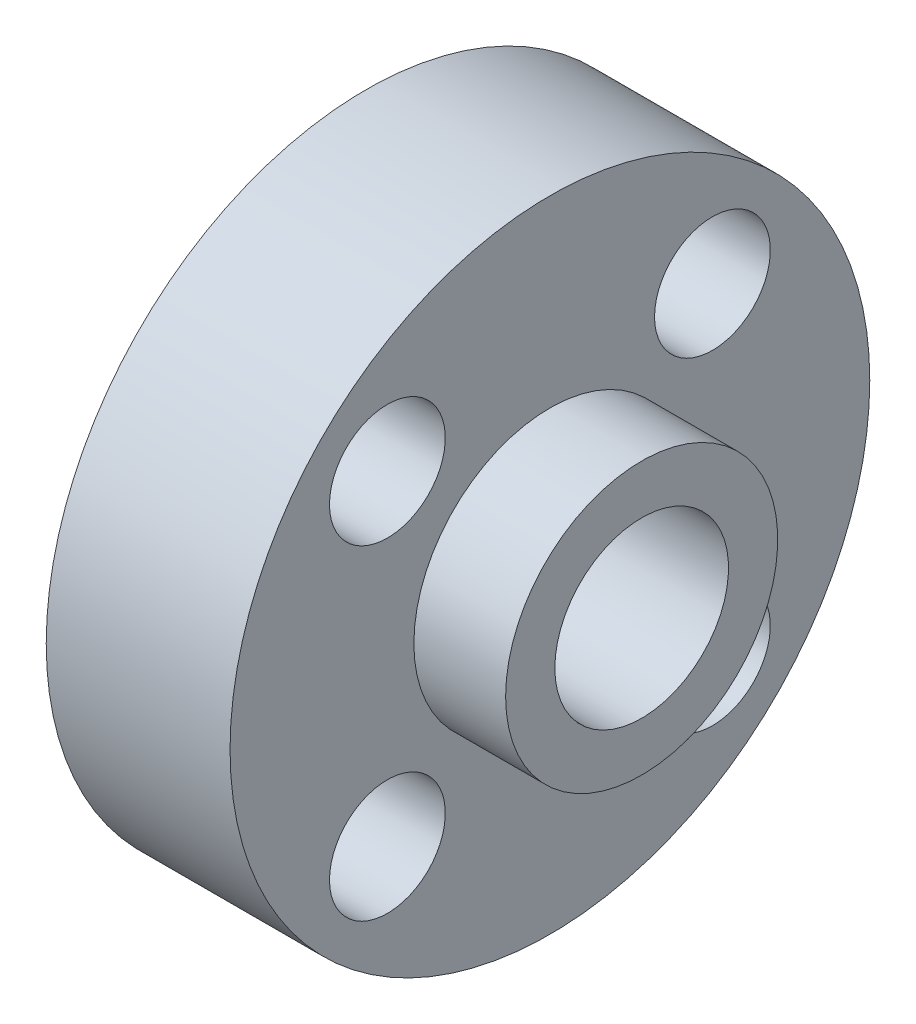
ISO-10303-21;
HEADER;
FILE_DESCRIPTION(('STEP AP214'),'2;1');
FILE_NAME('part.step','',(''),(''),'','','');
FILE_SCHEMA(('AUTOMOTIVE_DESIGN { 1 0 10303 214 1 1 1 1 }'));
ENDSEC;
DATA;
#1=APPLICATION_CONTEXT('core data for automotive mechanical design processes');
#2=APPLICATION_PROTOCOL_DEFINITION('international standard','automotive_design',2000,#1);
#3=PRODUCT_CONTEXT('',#1,'mechanical');
#4=PRODUCT('Part','Part','',(#3));
#5=PRODUCT_RELATED_PRODUCT_CATEGORY('part','',(#4));
#6=PRODUCT_DEFINITION_FORMATION('','',#4);
#7=PRODUCT_DEFINITION_CONTEXT('part definition',#1,'design');
#8=PRODUCT_DEFINITION('design','',#6,#7);
#9=PRODUCT_DEFINITION_SHAPE('','',#8);
#10=(LENGTH_UNIT() NAMED_UNIT(*) SI_UNIT(.MILLI.,.METRE.));
#11=(NAMED_UNIT(*) PLANE_ANGLE_UNIT() SI_UNIT($,.RADIAN.));
#12=(NAMED_UNIT(*) SI_UNIT($,.STERADIAN.) SOLID_ANGLE_UNIT());
#13=UNCERTAINTY_MEASURE_WITH_UNIT(LENGTH_MEASURE(1.E-05),#10,'distance_accuracy_value','');
#14=(GEOMETRIC_REPRESENTATION_CONTEXT(3) GLOBAL_UNCERTAINTY_ASSIGNED_CONTEXT((#13)) GLOBAL_UNIT_ASSIGNED_CONTEXT((#10,
#11,#12)) REPRESENTATION_CONTEXT('',''));
#15=CARTESIAN_POINT('',(0.,0.,0.));
#16=DIRECTION('',(0.,0.,1.));
#17=DIRECTION('',(1.,0.,0.));
#18=AXIS2_PLACEMENT_3D('',#15,#16,#17);
#19=CARTESIAN_POINT('',(-40.2001302083333,0.,0.));
#20=DIRECTION('',(1.,0.,0.));
#21=DIRECTION('',(0.,0.,-1.));
#22=AXIS2_PLACEMENT_3D('',#19,#20,#21);
#23=PLANE('',#22);
#24=CARTESIAN_POINT('',(-40.2001302083333,0.,0.));
#25=DIRECTION('',(-1.,0.,0.));
#26=DIRECTION('',(0.,0.,1.));
#27=AXIS2_PLACEMENT_3D('',#24,#25,#26);
#28=CIRCLE('',#27,3.);
#29=CARTESIAN_POINT('',(-40.2001302083333,0.,3.));
#30=VERTEX_POINT('',#29);
#31=EDGE_CURVE('E53',#30,#30,#28,.T.);
#32=ORIENTED_EDGE('',*,*,#31,.F.);
#33=EDGE_LOOP('',(#32));
#34=FACE_BOUND('',#33,.T.);
#35=CARTESIAN_POINT('',(-40.2001302083333,0.,0.));
#36=DIRECTION('',(-1.,0.,0.));
#37=DIRECTION('',(0.,0.,1.));
#38=AXIS2_PLACEMENT_3D('',#35,#36,#37);
#39=CIRCLE('',#38,4.7);
#40=CARTESIAN_POINT('',(-40.2001302083333,0.,4.7));
#41=VERTEX_POINT('',#40);
#42=EDGE_CURVE('E10',#41,#41,#39,.T.);
#43=ORIENTED_EDGE('',*,*,#42,.T.);
#44=EDGE_LOOP('',(#43));
#45=FACE_BOUND('',#44,.T.);
#46=ADVANCED_FACE('F30',(#34,#45),#23,.F.);
#47=CARTESIAN_POINT('',(-53.2970052083333,0.,0.));
#48=DIRECTION('',(-1.,0.,0.));
#49=DIRECTION('',(0.,0.,1.));
#50=AXIS2_PLACEMENT_3D('',#47,#48,#49);
#51=CYLINDRICAL_SURFACE('',#50,4.7);
#52=ORIENTED_EDGE('',*,*,#42,.F.);
#53=EDGE_LOOP('',(#52));
#54=FACE_BOUND('',#53,.T.);
#55=CARTESIAN_POINT('',(-37.0201302083333,0.,0.));
#56=DIRECTION('',(-1.,0.,0.));
#57=DIRECTION('',(0.,0.,1.));
#58=AXIS2_PLACEMENT_3D('',#55,#56,#57);
#59=CIRCLE('',#58,4.7);
#60=CARTESIAN_POINT('',(-37.0201302083333,0.,4.7));
#61=VERTEX_POINT('',#60);
#62=EDGE_CURVE('E41',#61,#61,#59,.T.);
#63=ORIENTED_EDGE('',*,*,#62,.T.);
#64=EDGE_LOOP('',(#63));
#65=FACE_BOUND('',#64,.T.);
#66=ADVANCED_FACE('F131',(#54,#65),#51,.T.);
#67=CARTESIAN_POINT('',(-37.0201302083333,0.,-4.7));
#68=DIRECTION('',(1.,0.,0.));
#69=DIRECTION('',(0.,0.,-1.));
#70=AXIS2_PLACEMENT_3D('',#67,#68,#69);
#71=PLANE('',#70);
#72=CARTESIAN_POINT('',(-37.0201302083333,5.61442784262126,5.61442784262112));
#73=DIRECTION('',(-1.,0.,0.));
#74=DIRECTION('',(0.,-1.,0.));
#75=AXIS2_PLACEMENT_3D('',#72,#73,#74);
#76=CIRCLE('',#75,2.);
#77=CARTESIAN_POINT('',(-37.0201302083333,3.61442784262126,5.61442784262114));
#78=VERTEX_POINT('',#77);
#79=EDGE_CURVE('E64',#78,#78,#76,.T.);
#80=ORIENTED_EDGE('',*,*,#79,.F.);
#81=EDGE_LOOP('',(#80));
#82=FACE_BOUND('',#81,.T.);
#83=CARTESIAN_POINT('',(-37.0201302083333,-5.61442784262118,5.6144278426212));
#84=DIRECTION('',(-1.,0.,0.));
#85=DIRECTION('',(0.,0.,-1.));
#86=AXIS2_PLACEMENT_3D('',#83,#84,#85);
#87=CIRCLE('',#86,2.);
#88=CARTESIAN_POINT('',(-37.0201302083333,-5.61442784262118,3.6144278426212));
#89=VERTEX_POINT('',#88);
#90=EDGE_CURVE('E61',#89,#89,#87,.T.);
#91=ORIENTED_EDGE('',*,*,#90,.F.);
#92=EDGE_LOOP('',(#91));
#93=FACE_BOUND('',#92,.T.);
#94=CARTESIAN_POINT('',(-37.0201302083333,-5.61442784262122,-5.61442784262116));
#95=DIRECTION('',(-1.,0.,0.));
#96=DIRECTION('',(0.,1.,0.));
#97=AXIS2_PLACEMENT_3D('',#94,#95,#96);
#98=CIRCLE('',#97,2.);
#99=CARTESIAN_POINT('',(-37.0201302083333,-3.61442784262122,-5.61442784262116));
#100=VERTEX_POINT('',#99);
#101=EDGE_CURVE('E58',#100,#100,#98,.T.);
#102=ORIENTED_EDGE('',*,*,#101,.F.);
#103=EDGE_LOOP('',(#102));
#104=FACE_BOUND('',#103,.T.);
#105=CARTESIAN_POINT('',(-37.0201302083333,5.61442784262118,-5.6144278426212));
#106=DIRECTION('',(-1.,0.,0.));
#107=DIRECTION('',(0.,0.,1.));
#108=AXIS2_PLACEMENT_3D('',#105,#106,#107);
#109=CIRCLE('',#108,2.);
#110=CARTESIAN_POINT('',(-37.0201302083333,5.61442784262118,-3.6144278426212));
#111=VERTEX_POINT('',#110);
#112=EDGE_CURVE('E54',#111,#111,#109,.T.);
#113=ORIENTED_EDGE('',*,*,#112,.F.);
#114=EDGE_LOOP('',(#113));
#115=FACE_BOUND('',#114,.T.);
#116=ORIENTED_EDGE('',*,*,#62,.F.);
#117=EDGE_LOOP('',(#116));
#118=FACE_BOUND('',#117,.T.);
#119=CARTESIAN_POINT('',(-37.0201302083333,0.,0.));
#120=DIRECTION('',(-1.,0.,0.));
#121=DIRECTION('',(0.,0.,1.));
#122=AXIS2_PLACEMENT_3D('',#119,#120,#121);
#123=CIRCLE('',#122,11.05);
#124=CARTESIAN_POINT('',(-37.0201302083333,0.,11.05));
#125=VERTEX_POINT('',#124);
#126=EDGE_CURVE('E46',#125,#125,#123,.T.);
#127=ORIENTED_EDGE('',*,*,#126,.T.);
#128=EDGE_LOOP('',(#127));
#129=FACE_BOUND('',#128,.T.);
#130=ADVANCED_FACE('F100',(#82,#93,#104,#115,#118,#129),#71,.F.);
#131=CARTESIAN_POINT('',(-53.2970052083333,0.,0.));
#132=DIRECTION('',(-1.,0.,0.));
#133=DIRECTION('',(0.,0.,1.));
#134=AXIS2_PLACEMENT_3D('',#131,#132,#133);
#135=CYLINDRICAL_SURFACE('',#134,11.05);
#136=CARTESIAN_POINT('',(-31.3451302083333,0.,-11.05));
#137=CARTESIAN_POINT('',(-31.3451347657817,0.138535178969198,-11.0499974686992));
#138=CARTESIAN_POINT('',(-31.3566842583246,0.277124414870294,-11.047368394039));
#139=CARTESIAN_POINT('',(-31.4025242809649,0.55035816038072,-11.0371346033821));
#140=CARTESIAN_POINT('',(-31.4368302897828,0.684999919826578,-11.0295265007553));
#141=CARTESIAN_POINT('',(-31.5270473952303,0.946351146069514,-11.0101807046834));
#142=CARTESIAN_POINT('',(-31.5829351392618,1.07306901532559,-10.9984474760714));
#143=CARTESIAN_POINT('',(-31.7146532533677,1.31532636423872,-10.9721139075424));
#144=CARTESIAN_POINT('',(-31.790483386229,1.43086597683789,-10.9575136017296));
#145=CARTESIAN_POINT('',(-31.9613051967248,1.64946582897903,-10.9267629293887));
#146=CARTESIAN_POINT('',(-32.0565727961294,1.75230761065863,-10.9105922318907));
#147=CARTESIAN_POINT('',(-32.2629732528739,1.94069721632042,-10.878664647576));
#148=CARTESIAN_POINT('',(-32.3741076035238,2.02624341068387,-10.8629077998747));
#149=CARTESIAN_POINT('',(-32.6107206403364,2.17859183261036,-10.8333905461894));
#150=CARTESIAN_POINT('',(-32.7363543412377,2.24515879528731,-10.8196561403144));
#151=CARTESIAN_POINT('',(-32.9973875487626,2.35614919880918,-10.796031791589));
#152=CARTESIAN_POINT('',(-33.1327857969257,2.40057548733988,-10.7861413543717));
#153=CARTESIAN_POINT('',(-33.4071271573634,2.46529609887246,-10.7715323060186));
#154=CARTESIAN_POINT('',(-33.5459741660384,2.48597862528871,-10.7667305989985));
#155=CARTESIAN_POINT('',(-33.8252439031697,2.5038321909553,-10.7625933128208));
#156=CARTESIAN_POINT('',(-33.965666421422,2.50100633029327,-10.7632570129314));
#157=CARTESIAN_POINT('',(-34.2411951057804,2.47223512536489,-10.7699004418861));
#158=CARTESIAN_POINT('',(-34.3763515328956,2.44674335015242,-10.775775873008));
#159=CARTESIAN_POINT('',(-34.6404182040461,2.37408365604073,-10.7920155533678));
#160=CARTESIAN_POINT('',(-34.7693280752597,2.32691444509448,-10.802380070168));
#161=CARTESIAN_POINT('',(-35.0185038963537,2.21182931829656,-10.8265312521615));
#162=CARTESIAN_POINT('',(-35.1386874920297,2.143741260663,-10.8403461270284));
#163=CARTESIAN_POINT('',(-35.3660900945078,1.9888720895275,-10.8698244596064));
#164=CARTESIAN_POINT('',(-35.4733072141066,1.90208826005324,-10.8854881857544));
#165=CARTESIAN_POINT('',(-35.6743420550986,1.70990181962498,-10.9173449250341));
#166=CARTESIAN_POINT('',(-35.7677914578564,1.60411416676263,-10.9335417895284));
#167=CARTESIAN_POINT('',(-35.9356854127979,1.37818254775952,-10.9643098473388));
#168=CARTESIAN_POINT('',(-36.010129572383,1.25803828512407,-10.9788810070688));
#169=CARTESIAN_POINT('',(-36.1380007993904,1.00633702781466,-11.0048085021139));
#170=CARTESIAN_POINT('',(-36.1913769690913,0.874753320469848,-11.0161570336327));
#171=CARTESIAN_POINT('',(-36.2751567132021,0.604169833161706,-11.034302968742));
#172=CARTESIAN_POINT('',(-36.3055638674121,0.465171212454925,-11.0411010815121));
#173=CARTESIAN_POINT('',(-36.3420006144425,0.186860495275626,-11.0492783517252));
#174=CARTESIAN_POINT('',(-36.348532963223,0.0476174133332158,-11.0507692507554));
#175=CARTESIAN_POINT('',(-36.3384010777072,-0.229970622720129,-11.0484784130789));
#176=CARTESIAN_POINT('',(-36.3217385329043,-0.36831564150772,-11.0446970603979));
#177=CARTESIAN_POINT('',(-36.266106270829,-0.638496033310976,-11.0323573731012));
#178=CARTESIAN_POINT('',(-36.2274026793795,-0.770389039953454,-11.0238560579555));
#179=CARTESIAN_POINT('',(-36.1290843232459,-1.02580957081328,-11.0030291180397));
#180=CARTESIAN_POINT('',(-36.0694676937165,-1.14933634782964,-10.9907031522313));
#181=CARTESIAN_POINT('',(-35.9299849441036,-1.38657900576045,-10.9633201008813));
#182=CARTESIAN_POINT('',(-35.8498266113306,-1.50011854849276,-10.9482245809437));
#183=CARTESIAN_POINT('',(-35.6719179909027,-1.71231494298578,-10.9170508820538));
#184=CARTESIAN_POINT('',(-35.5741652473163,-1.8109697135039,-10.9009725661242));
#185=CARTESIAN_POINT('',(-35.3615286403444,-1.99260346932019,-10.8692556152757));
#186=CARTESIAN_POINT('',(-35.2463437507104,-2.07523317138076,-10.8536320018118));
#187=CARTESIAN_POINT('',(-35.0034379902651,-2.21997934847289,-10.8249553465839));
#188=CARTESIAN_POINT('',(-34.8757176727781,-2.2820967284078,-10.811902191434));
#189=CARTESIAN_POINT('',(-34.6120603059594,-2.38362200906372,-10.7899743136361));
#190=CARTESIAN_POINT('',(-34.4761756340373,-2.42316049546664,-10.7810756193173));
#191=CARTESIAN_POINT('',(-34.1994620634576,-2.47878112159198,-10.7684248029988));
#192=CARTESIAN_POINT('',(-34.0586340239648,-2.49486731688939,-10.7646717911695));
#193=CARTESIAN_POINT('',(-33.7795599813477,-2.50294484254296,-10.7627961003508));
#194=CARTESIAN_POINT('',(-33.6413306207192,-2.49549089532478,-10.7645437941672));
#195=CARTESIAN_POINT('',(-33.3681529987284,-2.45794659316738,-10.7731779308509));
#196=CARTESIAN_POINT('',(-33.2332046929824,-2.42785654460879,-10.7800643041659));
#197=CARTESIAN_POINT('',(-32.970897725627,-2.34617054677613,-10.7981345431471));
#198=CARTESIAN_POINT('',(-32.8435109873545,-2.29466069270581,-10.8093011906911));
#199=CARTESIAN_POINT('',(-32.5991070426896,-2.17166931112005,-10.8346794116197));
#200=CARTESIAN_POINT('',(-32.4820910044047,-2.10018553759107,-10.8488913273947));
#201=CARTESIAN_POINT('',(-32.2590276686996,-1.9374587803661,-10.8791419628974));
#202=CARTESIAN_POINT('',(-32.1532714643818,-1.84582279327649,-10.8952134785653));
#203=CARTESIAN_POINT('',(-31.958455816679,-1.64618244704617,-10.9271580559927));
#204=CARTESIAN_POINT('',(-31.8694002557157,-1.53817429237176,-10.9430310708079));
#205=CARTESIAN_POINT('',(-31.7093064502271,-1.30701989814213,-10.9730559944475));
#206=CARTESIAN_POINT('',(-31.6385398358246,-1.18368175489585,-10.9871804925533));
#207=CARTESIAN_POINT('',(-31.5188556185285,-0.926563557240404,-11.0118391408392));
#208=CARTESIAN_POINT('',(-31.4699202891328,-0.792792078539198,-11.0223762022827));
#209=CARTESIAN_POINT('',(-31.403680853684,-0.549137810072976,-11.0368651946442));
#210=CARTESIAN_POINT('',(-31.3817674791712,-0.440540462306541,-11.0417594976069));
#211=CARTESIAN_POINT('',(-31.3524907030212,-0.221306840345493,-11.0483278301591));
#212=CARTESIAN_POINT('',(-31.3451265675551,-0.110670669268363,-11.0500020221633));
#213=CARTESIAN_POINT('',(-31.3451302083333,0.,-11.05));
#214=B_SPLINE_CURVE_WITH_KNOTS('',3,(#136,#137,#138,#139,#140,#141,#142,#143,#144,#145,#146,
#147,#148,#149,#150,#151,#152,#153,#154,#155,#156,#157,#158,#159,#160,#161,#162,#163,#164,#165,
#166,#167,#168,#169,#170,#171,#172,#173,#174,#175,#176,#177,#178,#179,#180,#181,#182,#183,#184,
#185,#186,#187,#188,#189,#190,#191,#192,#193,#194,#195,#196,#197,#198,#199,#200,#201,#202,#203,
#204,#205,#206,#207,#208,#209,#210,#211,#212,#213),.UNSPECIFIED.,.T.,.F.,(4,2,2,2,2,2,2,2,2,2,2,
2,2,2,2,2,2,2,2,2,2,2,2,2,2,2,2,2,2,2,2,2,2,2,2,2,2,2,4),(0.,0.415200333937034,
0.830683372350487,1.2457180898483,1.66074787076434,2.0821399607225,2.50357173645346,
2.9300205273311,3.35641445512039,3.77573297448606,4.19499619854192,4.60605374648434,
5.0171357979976,5.43169561673744,5.8463157000748,6.27054919340257,6.69479144957406,
7.1200524409568,7.54524714026966,7.96143474948825,8.37759204559127,8.78882803282417,
9.20010069988188,9.61758444403025,10.0351265082735,10.4609407255014,10.886736155378,
11.3100433735258,11.7332773810064,12.1466129574272,12.5599429394333,12.9716273913896,
13.3833581547979,13.8039713364727,14.2246821777895,14.6513225995566,15.0776159657674,
15.4093210026298,15.7410093086555),.UNSPECIFIED.);
#215=CARTESIAN_POINT('',(-31.3451302083333,0.,-11.05));
#216=VERTEX_POINT('',#215);
#217=EDGE_CURVE('E70',#216,#216,#214,.T.);
#218=ORIENTED_EDGE('',*,*,#217,.T.);
#219=EDGE_LOOP('',(#218));
#220=FACE_BOUND('',#219,.T.);
#221=ORIENTED_EDGE('',*,*,#126,.F.);
#222=EDGE_LOOP('',(#221));
#223=FACE_BOUND('',#222,.T.);
#224=CARTESIAN_POINT('',(-30.6701302083333,0.,0.));
#225=DIRECTION('',(-1.,0.,0.));
#226=DIRECTION('',(0.,0.,1.));
#227=AXIS2_PLACEMENT_3D('',#224,#225,#226);
#228=CIRCLE('',#227,11.05);
#229=CARTESIAN_POINT('',(-30.6701302083333,0.,11.05));
#230=VERTEX_POINT('',#229);
#231=EDGE_CURVE('E95',#230,#230,#228,.T.);
#232=ORIENTED_EDGE('',*,*,#231,.T.);
#233=EDGE_LOOP('',(#232));
#234=FACE_BOUND('',#233,.T.);
#235=ADVANCED_FACE('F102',(#220,#223,#234),#135,.T.);
#236=CARTESIAN_POINT('',(-30.6701302083333,0.,-11.05));
#237=DIRECTION('',(-1.,0.,0.));
#238=DIRECTION('',(0.,0.,1.));
#239=AXIS2_PLACEMENT_3D('',#236,#237,#238);
#240=PLANE('',#239);
#241=CARTESIAN_POINT('',(-30.6701302083333,5.61442784262126,5.61442784262112));
#242=DIRECTION('',(-1.,0.,0.));
#243=DIRECTION('',(0.,0.,1.));
#244=AXIS2_PLACEMENT_3D('',#241,#242,#243);
#245=CIRCLE('',#244,2.);
#246=CARTESIAN_POINT('',(-30.6701302083333,5.61442784262126,7.61442784262112));
#247=VERTEX_POINT('',#246);
#248=EDGE_CURVE('E62',#247,#247,#245,.T.);
#249=ORIENTED_EDGE('',*,*,#248,.T.);
#250=EDGE_LOOP('',(#249));
#251=FACE_BOUND('',#250,.T.);
#252=CARTESIAN_POINT('',(-30.6701302083333,-5.61442784262118,5.6144278426212));
#253=DIRECTION('',(-1.,0.,0.));
#254=DIRECTION('',(0.,0.,1.));
#255=AXIS2_PLACEMENT_3D('',#252,#253,#254);
#256=CIRCLE('',#255,2.);
#257=CARTESIAN_POINT('',(-30.6701302083333,-5.61442784262118,7.6144278426212));
#258=VERTEX_POINT('',#257);
#259=EDGE_CURVE('E59',#258,#258,#256,.T.);
#260=ORIENTED_EDGE('',*,*,#259,.T.);
#261=EDGE_LOOP('',(#260));
#262=FACE_BOUND('',#261,.T.);
#263=CARTESIAN_POINT('',(-30.6701302083333,-5.61442784262122,-5.61442784262116));
#264=DIRECTION('',(-1.,0.,0.));
#265=DIRECTION('',(0.,0.,1.));
#266=AXIS2_PLACEMENT_3D('',#263,#264,#265);
#267=CIRCLE('',#266,2.);
#268=CARTESIAN_POINT('',(-30.6701302083333,-5.61442784262122,-3.61442784262116));
#269=VERTEX_POINT('',#268);
#270=EDGE_CURVE('E55',#269,#269,#267,.T.);
#271=ORIENTED_EDGE('',*,*,#270,.T.);
#272=EDGE_LOOP('',(#271));
#273=FACE_BOUND('',#272,.T.);
#274=CARTESIAN_POINT('',(-30.6701302083333,5.61442784262118,-5.6144278426212));
#275=DIRECTION('',(-1.,0.,0.));
#276=DIRECTION('',(0.,0.,1.));
#277=AXIS2_PLACEMENT_3D('',#274,#275,#276);
#278=CIRCLE('',#277,2.);
#279=CARTESIAN_POINT('',(-30.6701302083333,5.61442784262118,-3.6144278426212));
#280=VERTEX_POINT('',#279);
#281=EDGE_CURVE('E50',#280,#280,#278,.T.);
#282=ORIENTED_EDGE('',*,*,#281,.T.);
#283=EDGE_LOOP('',(#282));
#284=FACE_BOUND('',#283,.T.);
#285=ORIENTED_EDGE('',*,*,#231,.F.);
#286=EDGE_LOOP('',(#285));
#287=FACE_BOUND('',#286,.T.);
#288=CARTESIAN_POINT('',(-30.6701302083333,0.,0.));
#289=DIRECTION('',(-1.,0.,0.));
#290=DIRECTION('',(0.,0.,1.));
#291=AXIS2_PLACEMENT_3D('',#288,#289,#290);
#292=CIRCLE('',#291,4.7);
#293=CARTESIAN_POINT('',(-30.6701302083333,0.,4.7));
#294=VERTEX_POINT('',#293);
#295=EDGE_CURVE('E92',#294,#294,#292,.T.);
#296=ORIENTED_EDGE('',*,*,#295,.T.);
#297=EDGE_LOOP('',(#296));
#298=FACE_BOUND('',#297,.T.);
#299=ADVANCED_FACE('F105',(#251,#262,#273,#284,#287,#298),#240,.F.);
#300=CARTESIAN_POINT('',(-53.2970052083333,0.,0.));
#301=DIRECTION('',(-1.,0.,0.));
#302=DIRECTION('',(0.,0.,1.));
#303=AXIS2_PLACEMENT_3D('',#300,#301,#302);
#304=CYLINDRICAL_SURFACE('',#303,4.7);
#305=ORIENTED_EDGE('',*,*,#295,.F.);
#306=EDGE_LOOP('',(#305));
#307=FACE_BOUND('',#306,.T.);
#308=CARTESIAN_POINT('',(-27.5001302083333,0.,0.));
#309=DIRECTION('',(-1.,0.,0.));
#310=DIRECTION('',(0.,0.,1.));
#311=AXIS2_PLACEMENT_3D('',#308,#309,#310);
#312=CIRCLE('',#311,4.7);
#313=CARTESIAN_POINT('',(-27.5001302083333,0.,4.7));
#314=VERTEX_POINT('',#313);
#315=EDGE_CURVE('E87',#314,#314,#312,.T.);
#316=ORIENTED_EDGE('',*,*,#315,.T.);
#317=EDGE_LOOP('',(#316));
#318=FACE_BOUND('',#317,.T.);
#319=ADVANCED_FACE('F111',(#307,#318),#304,.T.);
#320=CARTESIAN_POINT('',(-27.5001302083333,0.,-4.7));
#321=DIRECTION('',(-1.,0.,0.));
#322=DIRECTION('',(0.,0.,1.));
#323=AXIS2_PLACEMENT_3D('',#320,#321,#322);
#324=PLANE('',#323);
#325=CARTESIAN_POINT('',(-27.5001302083333,0.,0.));
#326=DIRECTION('',(-1.,0.,0.));
#327=DIRECTION('',(0.,0.,1.));
#328=AXIS2_PLACEMENT_3D('',#325,#326,#327);
#329=CIRCLE('',#328,3.);
#330=CARTESIAN_POINT('',(-27.5001302083333,0.,3.));
#331=VERTEX_POINT('',#330);
#332=EDGE_CURVE('E84',#331,#331,#329,.T.);
#333=ORIENTED_EDGE('',*,*,#332,.T.);
#334=EDGE_LOOP('',(#333));
#335=FACE_BOUND('',#334,.T.);
#336=ORIENTED_EDGE('',*,*,#315,.F.);
#337=EDGE_LOOP('',(#336));
#338=FACE_BOUND('',#337,.T.);
#339=ADVANCED_FACE('F117',(#335,#338),#324,.F.);
#340=CARTESIAN_POINT('',(-27.5001302083333,0.,0.));
#341=DIRECTION('',(-1.,0.,0.));
#342=DIRECTION('',(0.,0.,1.));
#343=AXIS2_PLACEMENT_3D('',#340,#341,#342);
#344=CYLINDRICAL_SURFACE('',#343,3.);
#345=CARTESIAN_POINT('',(-31.3451302083333,0.,-3.));
#346=CARTESIAN_POINT('',(-31.345135093887,-0.118757533193203,-2.99999522795205));
#347=CARTESIAN_POINT('',(-31.3536527122379,-0.237551281104128,-2.99288670594742));
#348=CARTESIAN_POINT('',(-31.3870929316851,-0.471182492492811,-2.96510762868268));
#349=CARTESIAN_POINT('',(-31.4120276823086,-0.586016959612417,-2.94442702942008));
#350=CARTESIAN_POINT('',(-31.476442325666,-0.807829942407298,-2.89142690238865));
#351=CARTESIAN_POINT('',(-31.515835282687,-0.914850920904904,-2.8591769655007));
#352=CARTESIAN_POINT('',(-31.6071472562759,-1.11984139043408,-2.78529176182902));
#353=CARTESIAN_POINT('',(-31.6590705050066,-1.21780780775234,-2.74365332434936));
#354=CARTESIAN_POINT('',(-31.7945839581415,-1.43789998519767,-2.63674191529867));
#355=CARTESIAN_POINT('',(-31.8828004125155,-1.5556821965722,-2.56840549256191));
#356=CARTESIAN_POINT('',(-32.0756545340847,-1.77202398328147,-2.42422624777673));
#357=CARTESIAN_POINT('',(-32.1803377775764,-1.87052845158605,-2.34836281453276));
#358=CARTESIAN_POINT('',(-32.3492144848244,-2.00437263805588,-2.23294886313738));
#359=CARTESIAN_POINT('',(-32.4080857845246,-2.04699726278816,-2.19383679994997));
#360=CARTESIAN_POINT('',(-32.5296358112938,-2.12715295529554,-2.11620611809194));
#361=CARTESIAN_POINT('',(-32.5923158032041,-2.16468231743739,-2.07768770195023));
#362=CARTESIAN_POINT('',(-32.7213975326689,-2.23441122570747,-2.00250543288661));
#363=CARTESIAN_POINT('',(-32.7877899930581,-2.26662332666227,-1.9658373575465));
#364=CARTESIAN_POINT('',(-32.9245764922617,-2.32553690612792,-1.89577686630311));
#365=CARTESIAN_POINT('',(-32.9949670556751,-2.3522430799868,-1.86238167220904));
#366=CARTESIAN_POINT('',(-33.1467972985334,-2.40193513934006,-1.79791918980412));
#367=CARTESIAN_POINT('',(-33.2286543010568,-2.42433807692598,-1.76736311251003));
#368=CARTESIAN_POINT('',(-33.3970199771464,-2.46101313675502,-1.71593180556003));
#369=CARTESIAN_POINT('',(-33.483516794948,-2.47530499393792,-1.69503310194197));
#370=CARTESIAN_POINT('',(-33.6608956167128,-2.49481072799048,-1.66620928968844));
#371=CARTESIAN_POINT('',(-33.751818167404,-2.49991205058667,-1.65844510563092));
#372=CARTESIAN_POINT('',(-33.9336928213361,-2.5000856937119,-1.65818308531825));
#373=CARTESIAN_POINT('',(-34.0246449249487,-2.49515788278405,-1.66568544916939));
#374=CARTESIAN_POINT('',(-34.2106549191604,-2.47505262029594,-1.69541639464497));
#375=CARTESIAN_POINT('',(-34.3054239540504,-2.45905577113332,-1.71881932066466));
#376=CARTESIAN_POINT('',(-34.4893411895355,-2.41742550503028,-1.77688235738913));
#377=CARTESIAN_POINT('',(-34.5784695790481,-2.3917601104429,-1.81157977103024));
#378=CARTESIAN_POINT('',(-34.7329572868744,-2.33816270346874,-1.88002226126136));
#379=CARTESIAN_POINT('',(-34.799442450745,-2.31177513033566,-1.91250316845438));
#380=CARTESIAN_POINT('',(-34.9287810151132,-2.25404424958637,-1.98021996661529));
#381=CARTESIAN_POINT('',(-34.9916322561992,-2.22269803586306,-2.01545746697785));
#382=CARTESIAN_POINT('',(-35.175097049353,-2.12149677560466,-2.12342648109724));
#383=CARTESIAN_POINT('',(-35.2905443559394,-2.04450664231778,-2.19837696967437));
#384=CARTESIAN_POINT('',(-35.5133971707877,-1.86765914501415,-2.35079897952277));
#385=CARTESIAN_POINT('',(-35.6200685323252,-1.76681805277629,-2.42819792618944));
#386=CARTESIAN_POINT('',(-35.8162425531507,-1.5448438833615,-2.57509054043284));
#387=CARTESIAN_POINT('',(-35.9057822413896,-1.42375565615774,-2.64460112267363));
#388=CARTESIAN_POINT('',(-36.0445450474319,-1.19411179169417,-2.75428914126547));
#389=CARTESIAN_POINT('',(-36.098273106521,-1.08972732107278,-2.79748350073995));
#390=CARTESIAN_POINT('',(-36.1914729535887,-0.871071458330379,-2.87307804019801));
#391=CARTESIAN_POINT('',(-36.2309536399139,-0.756806292780775,-2.90548495660805));
#392=CARTESIAN_POINT('',(-36.2935474582655,-0.51995430121543,-2.95709834265565));
#393=CARTESIAN_POINT('',(-36.3165341549909,-0.397310923125319,-2.97620280955844));
#394=CARTESIAN_POINT('',(-36.3438394402605,-0.148559976923737,-2.99891434528972));
#395=CARTESIAN_POINT('',(-36.3481705191835,-0.0224547835240113,-3.00253178304177));
#396=CARTESIAN_POINT('',(-36.3384677688896,0.213310199456566,-2.99444999039147));
#397=CARTESIAN_POINT('',(-36.3265715696182,0.32313054083585,-2.98453350716313));
#398=CARTESIAN_POINT('',(-36.2888632581218,0.538644964400596,-2.95325589460136));
#399=CARTESIAN_POINT('',(-36.2630494766144,0.644338549989553,-2.93189339242796));
#400=CARTESIAN_POINT('',(-36.1985068128781,0.850565499199248,-2.87889521546186));
#401=CARTESIAN_POINT('',(-36.1596094188891,0.951010682223306,-2.84712564891975));
#402=CARTESIAN_POINT('',(-36.0707345759966,1.14365900898103,-2.7753612473389));
#403=CARTESIAN_POINT('',(-36.02075303134,1.23585908831209,-2.73536337221809));
#404=CARTESIAN_POINT('',(-35.8866984129864,1.45067439735099,-2.62975152158594));
#405=CARTESIAN_POINT('',(-35.797397625066,1.5683435954073,-2.56070244234715));
#406=CARTESIAN_POINT('',(-35.6022898256777,1.78428994740847,-2.41522445403191));
#407=CARTESIAN_POINT('',(-35.4964317529786,1.88250490855172,-2.33877300422835));
#408=CARTESIAN_POINT('',(-35.3257182404047,2.0157331478429,-2.22269805598601));
#409=CARTESIAN_POINT('',(-35.2662319353573,2.05811069143949,-2.1834115173603));
#410=CARTESIAN_POINT('',(-35.1434093923011,2.13771669597406,-2.10553153817181));
#411=CARTESIAN_POINT('',(-35.0800717806692,2.17494330406755,-2.06693835133607));
#412=CARTESIAN_POINT('',(-34.9496418044181,2.24398857026757,-1.9917610848264));
#413=CARTESIAN_POINT('',(-34.8825599837997,2.27582148781537,-1.95517188634212));
#414=CARTESIAN_POINT('',(-34.7443401038335,2.33388856739459,-1.88547561448179));
#415=CARTESIAN_POINT('',(-34.673205837914,2.36012785984655,-1.85236536450791));
#416=CARTESIAN_POINT('',(-34.5208598399815,2.40837357148322,-1.78925557416047));
#417=CARTESIAN_POINT('',(-34.4392957572596,2.42988314318544,-1.75970711786654));
#418=CARTESIAN_POINT('',(-34.2716782543907,2.46482255689514,-1.71043063887427));
#419=CARTESIAN_POINT('',(-34.1856366370055,2.47827257713357,-1.69067811225259));
#420=CARTESIAN_POINT('',(-34.009492600921,2.49617289535263,-1.6641531597946));
#421=CARTESIAN_POINT('',(-33.9193548785827,2.5005179918396,-1.65753251048391));
#422=CARTESIAN_POINT('',(-33.7392769955494,2.49938197104456,-1.65924308630666));
#423=CARTESIAN_POINT('',(-33.6493368932082,2.49389826274012,-1.66757825402154));
#424=CARTESIAN_POINT('',(-33.4634576329428,2.47265263848541,-1.69892898735519));
#425=CARTESIAN_POINT('',(-33.3678999378007,2.45585812550762,-1.72341371023857));
#426=CARTESIAN_POINT('',(-33.1825989122506,2.41250339675092,-1.78358728037387));
#427=CARTESIAN_POINT('',(-33.092875979624,2.38591088285909,-1.81931312531326));
#428=CARTESIAN_POINT('',(-32.9373411669785,2.33050835844919,-1.88952619366194));
#429=CARTESIAN_POINT('',(-32.8703864490984,2.30325853049531,-1.92277816627791));
#430=CARTESIAN_POINT('',(-32.7401838219089,2.24370627018012,-1.9919518523057));
#431=CARTESIAN_POINT('',(-32.6769380973335,2.21140090020864,-2.0278751115052));
#432=CARTESIAN_POINT('',(-32.4924006469914,2.10716294428985,-2.13775931167912));
#433=CARTESIAN_POINT('',(-32.3763832833414,2.02793576743751,-2.2137978016432));
#434=CARTESIAN_POINT('',(-32.1531229470421,1.84629697567414,-2.36772603763546));
#435=CARTESIAN_POINT('',(-32.0465884143004,1.7429395959328,-2.44552394429512));
#436=CARTESIAN_POINT('',(-31.851266408794,1.51553554935621,-2.59256498427755));
#437=CARTESIAN_POINT('',(-31.7624396424594,1.39153583663215,-2.66182692543068));
#438=CARTESIAN_POINT('',(-31.6268160116102,1.15855518141083,-2.76942305781508));
#439=CARTESIAN_POINT('',(-31.5750916981139,1.05399877947693,-2.81112174006883));
#440=CARTESIAN_POINT('',(-31.4859115380947,0.835439786054356,-2.88361460666453));
#441=CARTESIAN_POINT('',(-31.448436684238,0.721450026753901,-2.9144233132377));
#442=CARTESIAN_POINT('',(-31.3949417525067,0.506620038886855,-2.95858745904691));
#443=CARTESIAN_POINT('',(-31.3763550861065,0.406845468761922,-2.97402142398111));
#444=CARTESIAN_POINT('',(-31.3514478400952,0.204722725654237,-2.99472922794408));
#445=CARTESIAN_POINT('',(-31.3451259967464,0.102374818922784,-3.00000411373941));
#446=CARTESIAN_POINT('',(-31.3451302083333,0.,-3.));
#447=B_SPLINE_CURVE_WITH_KNOTS('',3,(#345,#346,#347,#348,#349,#350,#351,#352,#353,#354,#355,
#356,#357,#358,#359,#360,#361,#362,#363,#364,#365,#366,#367,#368,#369,#370,#371,#372,#373,#374,
#375,#376,#377,#378,#379,#380,#381,#382,#383,#384,#385,#386,#387,#388,#389,#390,#391,#392,#393,
#394,#395,#396,#397,#398,#399,#400,#401,#402,#403,#404,#405,#406,#407,#408,#409,#410,#411,#412,
#413,#414,#415,#416,#417,#418,#419,#420,#421,#422,#423,#424,#425,#426,#427,#428,#429,#430,#431,
#432,#433,#434,#435,#436,#437,#438,#439,#440,#441,#442,#443,#444,#445,#446),.UNSPECIFIED.,.T.,
.F.,(4,2,2,2,2,2,2,2,2,2,2,2,2,2,2,2,2,2,2,2,2,2,2,2,2,2,2,2,2,2,2,2,2,2,2,2,2,2,2,2,2,2,2,2,2,
2,2,2,2,2,4),(0.,0.355841276815113,0.711946191026962,1.06594405359551,1.42006164830116,
1.90425178760127,2.38980643116775,2.63722280423449,2.88472179650724,3.13162777943677,
3.37832232674674,3.64812890035754,3.91727616616869,4.18969776924974,4.46212294312048,
4.75723524199722,5.05333228584568,5.28870178855694,5.52420974868633,5.9954933935898,
6.49137310548271,6.98616858956867,7.36002155957575,7.73364063000476,8.11009395319721,
8.48629519274361,8.81743460677927,9.14861374669872,9.48423297747607,9.81997643164434,
10.3065635514456,10.7946819775667,11.0432812121088,11.2919696391639,11.5399899810636,
11.787781852862,12.0551105531685,12.3217671309317,12.5914881373799,12.8612802568452,
13.1598101383752,13.4593330283462,13.6977271411687,13.9362602949129,14.4135864576438,
14.914300110886,15.413889999571,15.7841228897599,16.1538601797497,16.4606444271243,
16.7673970625124),.UNSPECIFIED.);
#448=CARTESIAN_POINT('',(-31.3451302083333,0.,-3.));
#449=VERTEX_POINT('',#448);
#450=EDGE_CURVE('E33',#449,#449,#447,.T.);
#451=ORIENTED_EDGE('',*,*,#450,.T.);
#452=EDGE_LOOP('',(#451));
#453=FACE_BOUND('',#452,.T.);
#454=ORIENTED_EDGE('',*,*,#332,.F.);
#455=EDGE_LOOP('',(#454));
#456=FACE_BOUND('',#455,.T.);
#457=ORIENTED_EDGE('',*,*,#31,.T.);
#458=EDGE_LOOP('',(#457));
#459=FACE_BOUND('',#458,.T.);
#460=ADVANCED_FACE('F122',(#453,#456,#459),#344,.F.);
#461=CARTESIAN_POINT('',(-27.0201302083333,5.61442784262118,-5.6144278426212));
#462=DIRECTION('',(-1.,0.,0.));
#463=DIRECTION('',(0.,0.,1.));
#464=AXIS2_PLACEMENT_3D('',#461,#462,#463);
#465=CYLINDRICAL_SURFACE('',#464,2.);
#466=ORIENTED_EDGE('',*,*,#112,.T.);
#467=EDGE_LOOP('',(#466));
#468=FACE_BOUND('',#467,.T.);
#469=ORIENTED_EDGE('',*,*,#281,.F.);
#470=EDGE_LOOP('',(#469));
#471=FACE_BOUND('',#470,.T.);
#472=ADVANCED_FACE('F128',(#468,#471),#465,.F.);
#473=CARTESIAN_POINT('',(-27.0201302083333,-5.61442784262122,-5.61442784262116));
#474=DIRECTION('',(-1.,0.,0.));
#475=DIRECTION('',(0.,0.,1.));
#476=AXIS2_PLACEMENT_3D('',#473,#474,#475);
#477=CYLINDRICAL_SURFACE('',#476,2.);
#478=ORIENTED_EDGE('',*,*,#101,.T.);
#479=EDGE_LOOP('',(#478));
#480=FACE_BOUND('',#479,.T.);
#481=ORIENTED_EDGE('',*,*,#270,.F.);
#482=EDGE_LOOP('',(#481));
#483=FACE_BOUND('',#482,.T.);
#484=ADVANCED_FACE('F159',(#480,#483),#477,.F.);
#485=CARTESIAN_POINT('',(-27.0201302083333,-5.61442784262118,5.6144278426212));
#486=DIRECTION('',(-1.,0.,0.));
#487=DIRECTION('',(0.,0.,1.));
#488=AXIS2_PLACEMENT_3D('',#485,#486,#487);
#489=CYLINDRICAL_SURFACE('',#488,2.);
#490=ORIENTED_EDGE('',*,*,#90,.T.);
#491=EDGE_LOOP('',(#490));
#492=FACE_BOUND('',#491,.T.);
#493=ORIENTED_EDGE('',*,*,#259,.F.);
#494=EDGE_LOOP('',(#493));
#495=FACE_BOUND('',#494,.T.);
#496=ADVANCED_FACE('F166',(#492,#495),#489,.F.);
#497=CARTESIAN_POINT('',(-27.0201302083333,5.61442784262126,5.61442784262112));
#498=DIRECTION('',(-1.,0.,0.));
#499=DIRECTION('',(0.,0.,1.));
#500=AXIS2_PLACEMENT_3D('',#497,#498,#499);
#501=CYLINDRICAL_SURFACE('',#500,2.);
#502=ORIENTED_EDGE('',*,*,#79,.T.);
#503=EDGE_LOOP('',(#502));
#504=FACE_BOUND('',#503,.T.);
#505=ORIENTED_EDGE('',*,*,#248,.F.);
#506=EDGE_LOOP('',(#505));
#507=FACE_BOUND('',#506,.T.);
#508=ADVANCED_FACE('F173',(#504,#507),#501,.F.);
#509=CARTESIAN_POINT('',(-33.8451302083333,0.,-11.05));
#510=DIRECTION('',(0.,0.,1.));
#511=DIRECTION('',(1.,0.,0.));
#512=AXIS2_PLACEMENT_3D('',#509,#510,#511);
#513=CYLINDRICAL_SURFACE('',#512,2.5);
#514=ORIENTED_EDGE('',*,*,#450,.F.);
#515=EDGE_LOOP('',(#514));
#516=FACE_BOUND('',#515,.T.);
#517=ORIENTED_EDGE('',*,*,#217,.F.);
#518=EDGE_LOOP('',(#517));
#519=FACE_BOUND('',#518,.T.);
#520=ADVANCED_FACE('F176',(#516,#519),#513,.F.);
#521=CLOSED_SHELL('',(#46,#66,#130,#235,#299,#319,#339,#460,#472,#484,#496,#508,#520));
#522=MANIFOLD_SOLID_BREP('B2',#521);
#523=ADVANCED_BREP_SHAPE_REPRESENTATION('',(#18,#522),#14);
#524=SHAPE_DEFINITION_REPRESENTATION(#9,#523);
ENDSEC;
END-ISO-10303-21;
